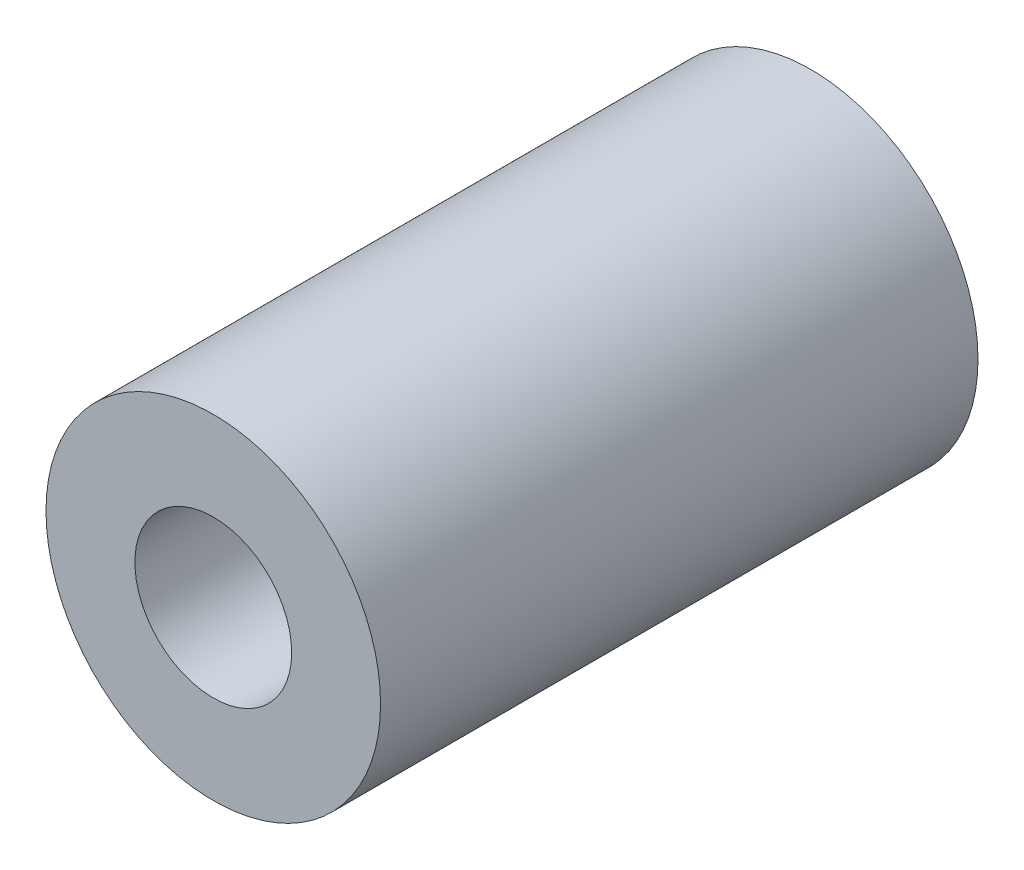
ISO-10303-21;
HEADER;
FILE_DESCRIPTION(('STEP AP214'),'2;1');
FILE_NAME('part.step','',(''),(''),'','','');
FILE_SCHEMA(('AUTOMOTIVE_DESIGN { 1 0 10303 214 1 1 1 1 }'));
ENDSEC;
DATA;
#1=APPLICATION_CONTEXT('core data for automotive mechanical design processes');
#2=APPLICATION_PROTOCOL_DEFINITION('international standard','automotive_design',2000,#1);
#3=PRODUCT_CONTEXT('',#1,'mechanical');
#4=PRODUCT('Part','Part','',(#3));
#5=PRODUCT_RELATED_PRODUCT_CATEGORY('part','',(#4));
#6=PRODUCT_DEFINITION_FORMATION('','',#4);
#7=PRODUCT_DEFINITION_CONTEXT('part definition',#1,'design');
#8=PRODUCT_DEFINITION('design','',#6,#7);
#9=PRODUCT_DEFINITION_SHAPE('','',#8);
#10=(LENGTH_UNIT() NAMED_UNIT(*) SI_UNIT(.MILLI.,.METRE.));
#11=(NAMED_UNIT(*) PLANE_ANGLE_UNIT() SI_UNIT($,.RADIAN.));
#12=(NAMED_UNIT(*) SI_UNIT($,.STERADIAN.) SOLID_ANGLE_UNIT());
#13=UNCERTAINTY_MEASURE_WITH_UNIT(LENGTH_MEASURE(1.E-05),#10,'distance_accuracy_value','');
#14=(GEOMETRIC_REPRESENTATION_CONTEXT(3) GLOBAL_UNCERTAINTY_ASSIGNED_CONTEXT((#13)) GLOBAL_UNIT_ASSIGNED_CONTEXT((#10,
#11,#12)) REPRESENTATION_CONTEXT('',''));
#15=CARTESIAN_POINT('',(0.,0.,0.));
#16=DIRECTION('',(0.,0.,1.));
#17=DIRECTION('',(1.,0.,0.));
#18=AXIS2_PLACEMENT_3D('',#15,#16,#17);
#19=CARTESIAN_POINT('',(0.,0.,19.05));
#20=DIRECTION('',(0.,0.,-1.));
#21=DIRECTION('',(-1.,0.,0.));
#22=AXIS2_PLACEMENT_3D('',#19,#20,#21);
#23=CYLINDRICAL_SURFACE('',#22,2.38125);
#24=CARTESIAN_POINT('',(0.,0.,0.));
#25=DIRECTION('',(0.,0.,1.));
#26=DIRECTION('',(1.,0.,0.));
#27=AXIS2_PLACEMENT_3D('',#24,#25,#26);
#28=CIRCLE('',#27,2.38125);
#29=CARTESIAN_POINT('',(2.38125,0.,0.));
#30=VERTEX_POINT('',#29);
#31=EDGE_CURVE('E57',#30,#30,#28,.T.);
#32=ORIENTED_EDGE('',*,*,#31,.F.);
#33=EDGE_LOOP('',(#32));
#34=FACE_BOUND('',#33,.T.);
#35=CARTESIAN_POINT('',(0.,0.,9.52500000000001));
#36=DIRECTION('',(0.,0.,1.));
#37=DIRECTION('',(1.,0.,0.));
#38=AXIS2_PLACEMENT_3D('',#35,#36,#37);
#39=CIRCLE('',#38,2.38125);
#40=CARTESIAN_POINT('',(2.38125,0.,9.52500000000001));
#41=VERTEX_POINT('',#40);
#42=EDGE_CURVE('E61',#41,#41,#39,.T.);
#43=ORIENTED_EDGE('',*,*,#42,.T.);
#44=EDGE_LOOP('',(#43));
#45=FACE_BOUND('',#44,.T.);
#46=ADVANCED_FACE('F44',(#34,#45),#23,.F.);
#47=CARTESIAN_POINT('',(0.,0.,19.05));
#48=DIRECTION('',(0.,0.,1.));
#49=DIRECTION('',(1.,0.,0.));
#50=AXIS2_PLACEMENT_3D('',#47,#48,#49);
#51=PLANE('',#50);
#52=CARTESIAN_POINT('',(0.,0.,19.05));
#53=DIRECTION('',(0.,0.,1.));
#54=DIRECTION('',(1.,0.,0.));
#55=AXIS2_PLACEMENT_3D('',#52,#53,#54);
#56=CIRCLE('',#55,2.5);
#57=CARTESIAN_POINT('',(2.5,0.,19.05));
#58=VERTEX_POINT('',#57);
#59=EDGE_CURVE('E48',#58,#58,#56,.T.);
#60=ORIENTED_EDGE('',*,*,#59,.F.);
#61=EDGE_LOOP('',(#60));
#62=FACE_BOUND('',#61,.T.);
#63=CARTESIAN_POINT('',(0.,0.,19.05));
#64=DIRECTION('',(0.,0.,1.));
#65=DIRECTION('',(1.,0.,0.));
#66=AXIS2_PLACEMENT_3D('',#63,#64,#65);
#67=CIRCLE('',#66,5.334);
#68=CARTESIAN_POINT('',(5.334,0.,19.05));
#69=VERTEX_POINT('',#68);
#70=EDGE_CURVE('E12',#69,#69,#67,.T.);
#71=ORIENTED_EDGE('',*,*,#70,.T.);
#72=EDGE_LOOP('',(#71));
#73=FACE_BOUND('',#72,.T.);
#74=ADVANCED_FACE('F86',(#62,#73),#51,.T.);
#75=CARTESIAN_POINT('',(0.,0.,0.));
#76=DIRECTION('',(0.,0.,1.));
#77=DIRECTION('',(1.,0.,0.));
#78=AXIS2_PLACEMENT_3D('',#75,#76,#77);
#79=PLANE('',#78);
#80=CARTESIAN_POINT('',(0.,0.,0.));
#81=DIRECTION('',(0.,0.,1.));
#82=DIRECTION('',(1.,0.,0.));
#83=AXIS2_PLACEMENT_3D('',#80,#81,#82);
#84=CIRCLE('',#83,5.334);
#85=CARTESIAN_POINT('',(5.334,0.,0.));
#86=VERTEX_POINT('',#85);
#87=EDGE_CURVE('E52',#86,#86,#84,.T.);
#88=ORIENTED_EDGE('',*,*,#87,.F.);
#89=EDGE_LOOP('',(#88));
#90=FACE_BOUND('',#89,.T.);
#91=ORIENTED_EDGE('',*,*,#31,.T.);
#92=EDGE_LOOP('',(#91));
#93=FACE_BOUND('',#92,.T.);
#94=ADVANCED_FACE('F82',(#90,#93),#79,.F.);
#95=CARTESIAN_POINT('',(0.,0.,19.05));
#96=DIRECTION('',(0.,0.,-1.));
#97=DIRECTION('',(-1.,0.,0.));
#98=AXIS2_PLACEMENT_3D('',#95,#96,#97);
#99=CYLINDRICAL_SURFACE('',#98,5.334);
#100=ORIENTED_EDGE('',*,*,#70,.F.);
#101=EDGE_LOOP('',(#100));
#102=FACE_BOUND('',#101,.T.);
#103=ORIENTED_EDGE('',*,*,#87,.T.);
#104=EDGE_LOOP('',(#103));
#105=FACE_BOUND('',#104,.T.);
#106=ADVANCED_FACE('F46',(#102,#105),#99,.T.);
#107=CARTESIAN_POINT('',(0.,0.,9.52500000000001));
#108=DIRECTION('',(0.,0.,1.));
#109=DIRECTION('',(1.,0.,0.));
#110=AXIS2_PLACEMENT_3D('',#107,#108,#109);
#111=CYLINDRICAL_SURFACE('',#110,2.5);
#112=ORIENTED_EDGE('',*,*,#59,.T.);
#113=EDGE_LOOP('',(#112));
#114=FACE_BOUND('',#113,.T.);
#115=CARTESIAN_POINT('',(0.,0.,9.52500000000001));
#116=DIRECTION('',(0.,0.,1.));
#117=DIRECTION('',(1.,0.,0.));
#118=AXIS2_PLACEMENT_3D('',#115,#116,#117);
#119=CIRCLE('',#118,2.5);
#120=CARTESIAN_POINT('',(2.5,0.,9.52500000000001));
#121=VERTEX_POINT('',#120);
#122=EDGE_CURVE('E63',#121,#121,#119,.T.);
#123=ORIENTED_EDGE('',*,*,#122,.F.);
#124=EDGE_LOOP('',(#123));
#125=FACE_BOUND('',#124,.T.);
#126=ADVANCED_FACE('F72',(#114,#125),#111,.F.);
#127=CARTESIAN_POINT('',(0.,0.,9.52500000000001));
#128=DIRECTION('',(0.,0.,1.));
#129=DIRECTION('',(1.,0.,0.));
#130=AXIS2_PLACEMENT_3D('',#127,#128,#129);
#131=PLANE('',#130);
#132=ORIENTED_EDGE('',*,*,#42,.F.);
#133=EDGE_LOOP('',(#132));
#134=FACE_BOUND('',#133,.T.);
#135=ORIENTED_EDGE('',*,*,#122,.T.);
#136=EDGE_LOOP('',(#135));
#137=FACE_BOUND('',#136,.T.);
#138=ADVANCED_FACE('F70',(#134,#137),#131,.T.);
#139=CLOSED_SHELL('',(#46,#74,#94,#106,#126,#138));
#140=MANIFOLD_SOLID_BREP('B2',#139);
#141=ADVANCED_BREP_SHAPE_REPRESENTATION('',(#18,#140),#14);
#142=SHAPE_DEFINITION_REPRESENTATION(#9,#141);
ENDSEC;
END-ISO-10303-21;
